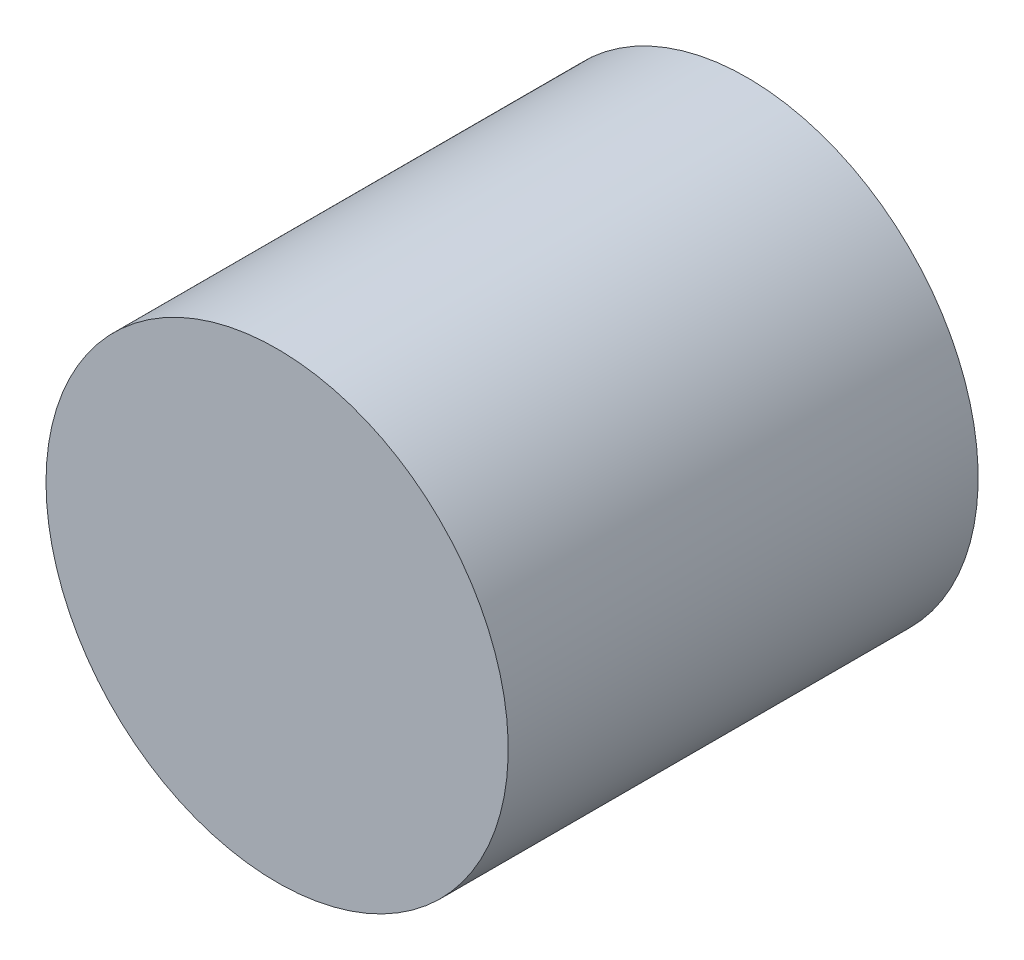
ISO-10303-21;
HEADER;
FILE_DESCRIPTION(('STEP AP214'),'2;1');
FILE_NAME('part.step','',(''),(''),'','','');
FILE_SCHEMA(('AUTOMOTIVE_DESIGN { 1 0 10303 214 1 1 1 1 }'));
ENDSEC;
DATA;
#1=APPLICATION_CONTEXT('core data for automotive mechanical design processes');
#2=APPLICATION_PROTOCOL_DEFINITION('international standard','automotive_design',2000,#1);
#3=PRODUCT_CONTEXT('',#1,'mechanical');
#4=PRODUCT('Part','Part','',(#3));
#5=PRODUCT_RELATED_PRODUCT_CATEGORY('part','',(#4));
#6=PRODUCT_DEFINITION_FORMATION('','',#4);
#7=PRODUCT_DEFINITION_CONTEXT('part definition',#1,'design');
#8=PRODUCT_DEFINITION('design','',#6,#7);
#9=PRODUCT_DEFINITION_SHAPE('','',#8);
#10=(LENGTH_UNIT() NAMED_UNIT(*) SI_UNIT(.MILLI.,.METRE.));
#11=(NAMED_UNIT(*) PLANE_ANGLE_UNIT() SI_UNIT($,.RADIAN.));
#12=(NAMED_UNIT(*) SI_UNIT($,.STERADIAN.) SOLID_ANGLE_UNIT());
#13=UNCERTAINTY_MEASURE_WITH_UNIT(LENGTH_MEASURE(1.E-05),#10,'distance_accuracy_value','');
#14=(GEOMETRIC_REPRESENTATION_CONTEXT(3) GLOBAL_UNCERTAINTY_ASSIGNED_CONTEXT((#13)) GLOBAL_UNIT_ASSIGNED_CONTEXT((#10,
#11,#12)) REPRESENTATION_CONTEXT('',''));
#15=CARTESIAN_POINT('',(0.,0.,0.));
#16=DIRECTION('',(0.,0.,1.));
#17=DIRECTION('',(1.,0.,0.));
#18=AXIS2_PLACEMENT_3D('',#15,#16,#17);
#19=CARTESIAN_POINT('',(0.,0.,0.));
#20=DIRECTION('',(0.,0.,-1.));
#21=DIRECTION('',(-1.,0.,0.));
#22=AXIS2_PLACEMENT_3D('',#19,#20,#21);
#23=PLANE('',#22);
#24=CARTESIAN_POINT('',(0.,0.,0.));
#25=DIRECTION('',(0.,0.,1.));
#26=DIRECTION('',(1.,0.,0.));
#27=AXIS2_PLACEMENT_3D('',#24,#25,#26);
#28=CIRCLE('',#27,1.75);
#29=CARTESIAN_POINT('',(1.75,0.,0.));
#30=VERTEX_POINT('',#29);
#31=EDGE_CURVE('E54',#30,#30,#28,.T.);
#32=ORIENTED_EDGE('',*,*,#31,.F.);
#33=EDGE_LOOP('',(#32));
#34=FACE_BOUND('',#33,.T.);
#35=ADVANCED_FACE('F51',(#34),#23,.T.);
#36=CARTESIAN_POINT('',(0.,0.,0.));
#37=DIRECTION('',(0.,0.,1.));
#38=DIRECTION('',(1.,0.,0.));
#39=AXIS2_PLACEMENT_3D('',#36,#37,#38);
#40=CYLINDRICAL_SURFACE('',#39,1.75);
#41=CARTESIAN_POINT('',(0.,0.,0.7));
#42=DIRECTION('',(0.,0.,1.));
#43=DIRECTION('',(1.,0.,0.));
#44=AXIS2_PLACEMENT_3D('',#41,#42,#43);
#45=CIRCLE('',#44,1.75);
#46=CARTESIAN_POINT('',(1.75,0.,0.7));
#47=VERTEX_POINT('',#46);
#48=EDGE_CURVE('E59',#47,#47,#45,.F.);
#49=ORIENTED_EDGE('',*,*,#48,.T.);
#50=EDGE_LOOP('',(#49));
#51=FACE_BOUND('',#50,.T.);
#52=ORIENTED_EDGE('',*,*,#31,.T.);
#53=EDGE_LOOP('',(#52));
#54=FACE_BOUND('',#53,.T.);
#55=ADVANCED_FACE('F96',(#51,#54),#40,.T.);
#56=CARTESIAN_POINT('',(-0.7,3.,6.80000000002664));
#57=DIRECTION('',(0.,0.,-1.));
#58=DIRECTION('',(-1.,0.,0.));
#59=AXIS2_PLACEMENT_3D('',#56,#57,#58);
#60=PLANE('',#59);
#61=CARTESIAN_POINT('',(0.,0.,6.80000000002664));
#62=DIRECTION('',(0.,0.,-1.));
#63=DIRECTION('',(-1.,0.,0.));
#64=AXIS2_PLACEMENT_3D('',#61,#62,#63);
#65=CIRCLE('',#64,3.);
#66=CARTESIAN_POINT('',(-3.,0.,6.80000000002664));
#67=VERTEX_POINT('',#66);
#68=EDGE_CURVE('E64',#67,#67,#65,.T.);
#69=ORIENTED_EDGE('',*,*,#68,.F.);
#70=EDGE_LOOP('',(#69));
#71=FACE_BOUND('',#70,.T.);
#72=ADVANCED_FACE('F104',(#71),#60,.F.);
#73=CARTESIAN_POINT('',(0.,0.,0.7));
#74=DIRECTION('',(0.,0.,1.));
#75=DIRECTION('',(1.,0.,0.));
#76=AXIS2_PLACEMENT_3D('',#73,#74,#75);
#77=PLANE('',#76);
#78=CARTESIAN_POINT('',(0.,0.,0.699999999999999));
#79=DIRECTION('',(0.,0.,-1.));
#80=DIRECTION('',(-1.,0.,0.));
#81=AXIS2_PLACEMENT_3D('',#78,#79,#80);
#82=CIRCLE('',#81,3.);
#83=CARTESIAN_POINT('',(-3.,0.,0.699999999999999));
#84=VERTEX_POINT('',#83);
#85=EDGE_CURVE('E12',#84,#84,#82,.F.);
#86=ORIENTED_EDGE('',*,*,#85,.F.);
#87=EDGE_LOOP('',(#86));
#88=FACE_BOUND('',#87,.T.);
#89=ORIENTED_EDGE('',*,*,#48,.F.);
#90=EDGE_LOOP('',(#89));
#91=FACE_BOUND('',#90,.T.);
#92=ADVANCED_FACE('F108',(#88,#91),#77,.F.);
#93=CARTESIAN_POINT('',(0.,0.,18.));
#94=DIRECTION('',(0.,0.,-1.));
#95=DIRECTION('',(-1.,0.,0.));
#96=AXIS2_PLACEMENT_3D('',#93,#94,#95);
#97=CYLINDRICAL_SURFACE('',#96,3.);
#98=ORIENTED_EDGE('',*,*,#68,.T.);
#99=EDGE_LOOP('',(#98));
#100=FACE_BOUND('',#99,.T.);
#101=ORIENTED_EDGE('',*,*,#85,.T.);
#102=EDGE_LOOP('',(#101));
#103=FACE_BOUND('',#102,.T.);
#104=ADVANCED_FACE('F106',(#100,#103),#97,.T.);
#105=CLOSED_SHELL('',(#35,#55,#72,#92,#104));
#106=MANIFOLD_SOLID_BREP('B2',#105);
#107=ADVANCED_BREP_SHAPE_REPRESENTATION('',(#18,#106),#14);
#108=SHAPE_DEFINITION_REPRESENTATION(#9,#107);
ENDSEC;
END-ISO-10303-21;
